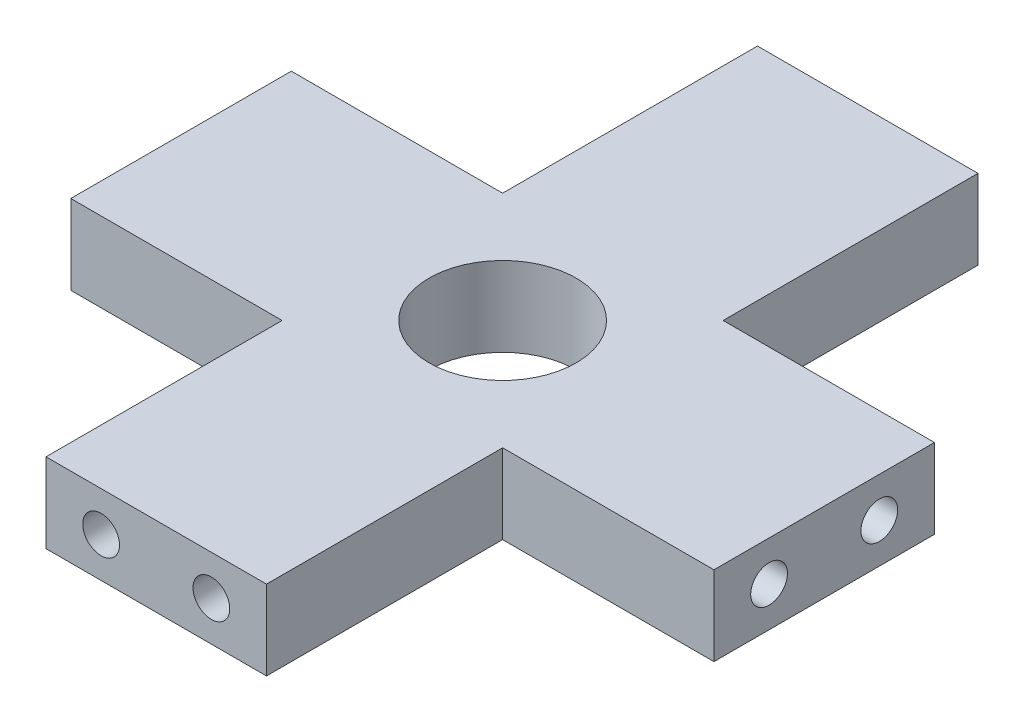
ISO-10303-21;
HEADER;
FILE_DESCRIPTION(('STEP AP214'),'2;1');
FILE_NAME('part.step','',(''),(''),'','','');
FILE_SCHEMA(('AUTOMOTIVE_DESIGN { 1 0 10303 214 1 1 1 1 }'));
ENDSEC;
DATA;
#1=APPLICATION_CONTEXT('core data for automotive mechanical design processes');
#2=APPLICATION_PROTOCOL_DEFINITION('international standard','automotive_design',2000,#1);
#3=PRODUCT_CONTEXT('',#1,'mechanical');
#4=PRODUCT('Part','Part','',(#3));
#5=PRODUCT_RELATED_PRODUCT_CATEGORY('part','',(#4));
#6=PRODUCT_DEFINITION_FORMATION('','',#4);
#7=PRODUCT_DEFINITION_CONTEXT('part definition',#1,'design');
#8=PRODUCT_DEFINITION('design','',#6,#7);
#9=PRODUCT_DEFINITION_SHAPE('','',#8);
#10=(LENGTH_UNIT() NAMED_UNIT(*) SI_UNIT(.MILLI.,.METRE.));
#11=(NAMED_UNIT(*) PLANE_ANGLE_UNIT() SI_UNIT($,.RADIAN.));
#12=(NAMED_UNIT(*) SI_UNIT($,.STERADIAN.) SOLID_ANGLE_UNIT());
#13=UNCERTAINTY_MEASURE_WITH_UNIT(LENGTH_MEASURE(1.E-05),#10,'distance_accuracy_value','');
#14=(GEOMETRIC_REPRESENTATION_CONTEXT(3) GLOBAL_UNCERTAINTY_ASSIGNED_CONTEXT((#13)) GLOBAL_UNIT_ASSIGNED_CONTEXT((#10,
#11,#12)) REPRESENTATION_CONTEXT('',''));
#15=CARTESIAN_POINT('',(0.,0.,0.));
#16=DIRECTION('',(0.,0.,1.));
#17=DIRECTION('',(1.,0.,0.));
#18=AXIS2_PLACEMENT_3D('',#15,#16,#17);
#19=CARTESIAN_POINT('',(0.,4.33,0.));
#20=DIRECTION('',(0.,-1.,0.));
#21=DIRECTION('',(0.,0.,-1.));
#22=AXIS2_PLACEMENT_3D('',#19,#20,#21);
#23=PLANE('',#22);
#24=DIRECTION('',(0.,0.,1.));
#25=VECTOR('',#24,1.);
#26=CARTESIAN_POINT('',(0.,4.33,0.));
#27=LINE('',#26,#25);
#28=CARTESIAN_POINT('',(0.,4.33,-12.85));
#29=VERTEX_POINT('',#28);
#30=CARTESIAN_POINT('',(0.,4.33,0.));
#31=VERTEX_POINT('',#30);
#32=EDGE_CURVE('E176',#29,#31,#27,.T.);
#33=ORIENTED_EDGE('',*,*,#32,.T.);
#34=DIRECTION('',(1.,0.,0.));
#35=VECTOR('',#34,1.);
#36=CARTESIAN_POINT('',(0.,4.33,0.));
#37=LINE('',#36,#35);
#38=CARTESIAN_POINT('',(12.,4.33,0.));
#39=VERTEX_POINT('',#38);
#40=EDGE_CURVE('E104',#31,#39,#37,.T.);
#41=ORIENTED_EDGE('',*,*,#40,.T.);
#42=DIRECTION('',(0.,0.,-1.));
#43=VECTOR('',#42,1.);
#44=CARTESIAN_POINT('',(12.,4.33,0.));
#45=LINE('',#44,#43);
#46=CARTESIAN_POINT('',(12.,4.33,-12.85));
#47=VERTEX_POINT('',#46);
#48=EDGE_CURVE('E203',#39,#47,#45,.T.);
#49=ORIENTED_EDGE('',*,*,#48,.T.);
#50=DIRECTION('',(1.,0.,0.));
#51=VECTOR('',#50,1.);
#52=CARTESIAN_POINT('',(12.,4.33,-12.85));
#53=LINE('',#52,#51);
#54=CARTESIAN_POINT('',(23.5,4.33,-12.85));
#55=VERTEX_POINT('',#54);
#56=EDGE_CURVE('E222',#47,#55,#53,.T.);
#57=ORIENTED_EDGE('',*,*,#56,.T.);
#58=DIRECTION('',(0.,0.,-1.));
#59=VECTOR('',#58,1.);
#60=CARTESIAN_POINT('',(23.5,4.33,-24.85));
#61=LINE('',#60,#59);
#62=CARTESIAN_POINT('',(23.5,4.33,-24.85));
#63=VERTEX_POINT('',#62);
#64=EDGE_CURVE('E219',#55,#63,#61,.T.);
#65=ORIENTED_EDGE('',*,*,#64,.T.);
#66=DIRECTION('',(-1.,0.,0.));
#67=VECTOR('',#66,1.);
#68=CARTESIAN_POINT('',(12.,4.33,-24.85));
#69=LINE('',#68,#67);
#70=CARTESIAN_POINT('',(12.,4.33,-24.85));
#71=VERTEX_POINT('',#70);
#72=EDGE_CURVE('E221',#63,#71,#69,.T.);
#73=ORIENTED_EDGE('',*,*,#72,.T.);
#74=DIRECTION('',(0.,0.,-1.));
#75=VECTOR('',#74,1.);
#76=CARTESIAN_POINT('',(12.,4.33,-24.85));
#77=LINE('',#76,#75);
#78=CARTESIAN_POINT('',(12.,4.33,-38.72));
#79=VERTEX_POINT('',#78);
#80=EDGE_CURVE('E224',#71,#79,#77,.T.);
#81=ORIENTED_EDGE('',*,*,#80,.T.);
#82=DIRECTION('',(-1.,0.,0.));
#83=VECTOR('',#82,1.);
#84=CARTESIAN_POINT('',(0.,4.33,-38.72));
#85=LINE('',#84,#83);
#86=CARTESIAN_POINT('',(0.,4.33,-38.72));
#87=VERTEX_POINT('',#86);
#88=EDGE_CURVE('E230',#79,#87,#85,.T.);
#89=ORIENTED_EDGE('',*,*,#88,.T.);
#90=DIRECTION('',(0.,0.,1.));
#91=VECTOR('',#90,1.);
#92=CARTESIAN_POINT('',(0.,4.33,-24.85));
#93=LINE('',#92,#91);
#94=CARTESIAN_POINT('',(0.,4.33,-24.85));
#95=VERTEX_POINT('',#94);
#96=EDGE_CURVE('E135',#87,#95,#93,.T.);
#97=ORIENTED_EDGE('',*,*,#96,.T.);
#98=DIRECTION('',(-1.,0.,0.));
#99=VECTOR('',#98,1.);
#100=CARTESIAN_POINT('',(-11.5,4.33,-24.85));
#101=LINE('',#100,#99);
#102=CARTESIAN_POINT('',(-11.5,4.33,-24.85));
#103=VERTEX_POINT('',#102);
#104=EDGE_CURVE('E129',#95,#103,#101,.T.);
#105=ORIENTED_EDGE('',*,*,#104,.T.);
#106=DIRECTION('',(0.,0.,1.));
#107=VECTOR('',#106,1.);
#108=CARTESIAN_POINT('',(-11.5,4.33,-24.85));
#109=LINE('',#108,#107);
#110=CARTESIAN_POINT('',(-11.5,4.33,-12.85));
#111=VERTEX_POINT('',#110);
#112=EDGE_CURVE('E133',#103,#111,#109,.T.);
#113=ORIENTED_EDGE('',*,*,#112,.T.);
#114=DIRECTION('',(1.,0.,0.));
#115=VECTOR('',#114,1.);
#116=CARTESIAN_POINT('',(-11.5,4.33,-12.85));
#117=LINE('',#116,#115);
#118=EDGE_CURVE('E49',#111,#29,#117,.T.);
#119=ORIENTED_EDGE('',*,*,#118,.T.);
#120=EDGE_LOOP('',(#33,#41,#49,#57,#65,#73,#81,#89,#97,#105,#113,#119));
#121=FACE_BOUND('',#120,.T.);
#122=CARTESIAN_POINT('',(6.,4.33,-18.85));
#123=DIRECTION('',(0.,1.,0.));
#124=DIRECTION('',(0.,0.,1.));
#125=AXIS2_PLACEMENT_3D('',#122,#123,#124);
#126=CIRCLE('',#125,4.);
#127=CARTESIAN_POINT('',(6.,4.33,-14.85));
#128=VERTEX_POINT('',#127);
#129=EDGE_CURVE('E157',#128,#128,#126,.T.);
#130=ORIENTED_EDGE('',*,*,#129,.F.);
#131=EDGE_LOOP('',(#130));
#132=FACE_BOUND('',#131,.T.);
#133=ADVANCED_FACE('F32',(#121,#132),#23,.F.);
#134=CARTESIAN_POINT('',(0.,0.,0.));
#135=DIRECTION('',(0.,-1.,0.));
#136=DIRECTION('',(0.,0.,-1.));
#137=AXIS2_PLACEMENT_3D('',#134,#135,#136);
#138=PLANE('',#137);
#139=DIRECTION('',(0.,0.,1.));
#140=VECTOR('',#139,1.);
#141=CARTESIAN_POINT('',(0.,0.,0.));
#142=LINE('',#141,#140);
#143=CARTESIAN_POINT('',(0.,0.,-12.85));
#144=VERTEX_POINT('',#143);
#145=CARTESIAN_POINT('',(0.,0.,0.));
#146=VERTEX_POINT('',#145);
#147=EDGE_CURVE('E153',#144,#146,#142,.T.);
#148=ORIENTED_EDGE('',*,*,#147,.F.);
#149=DIRECTION('',(1.,0.,0.));
#150=VECTOR('',#149,1.);
#151=CARTESIAN_POINT('',(-11.5,0.,-12.85));
#152=LINE('',#151,#150);
#153=CARTESIAN_POINT('',(-11.5,0.,-12.85));
#154=VERTEX_POINT('',#153);
#155=EDGE_CURVE('E96',#154,#144,#152,.T.);
#156=ORIENTED_EDGE('',*,*,#155,.F.);
#157=DIRECTION('',(0.,0.,1.));
#158=VECTOR('',#157,1.);
#159=CARTESIAN_POINT('',(-11.5,0.,-24.85));
#160=LINE('',#159,#158);
#161=CARTESIAN_POINT('',(-11.5,0.,-24.85));
#162=VERTEX_POINT('',#161);
#163=EDGE_CURVE('E90',#162,#154,#160,.T.);
#164=ORIENTED_EDGE('',*,*,#163,.F.);
#165=DIRECTION('',(-1.,0.,0.));
#166=VECTOR('',#165,1.);
#167=CARTESIAN_POINT('',(-11.5,0.,-24.85));
#168=LINE('',#167,#166);
#169=CARTESIAN_POINT('',(0.,0.,-24.85));
#170=VERTEX_POINT('',#169);
#171=EDGE_CURVE('E143',#170,#162,#168,.T.);
#172=ORIENTED_EDGE('',*,*,#171,.F.);
#173=DIRECTION('',(0.,0.,1.));
#174=VECTOR('',#173,1.);
#175=CARTESIAN_POINT('',(0.,0.,-24.85));
#176=LINE('',#175,#174);
#177=CARTESIAN_POINT('',(0.,0.,-38.72));
#178=VERTEX_POINT('',#177);
#179=EDGE_CURVE('E171',#178,#170,#176,.T.);
#180=ORIENTED_EDGE('',*,*,#179,.F.);
#181=DIRECTION('',(-1.,0.,0.));
#182=VECTOR('',#181,1.);
#183=CARTESIAN_POINT('',(0.,0.,-38.72));
#184=LINE('',#183,#182);
#185=CARTESIAN_POINT('',(12.,0.,-38.72));
#186=VERTEX_POINT('',#185);
#187=EDGE_CURVE('E169',#186,#178,#184,.T.);
#188=ORIENTED_EDGE('',*,*,#187,.F.);
#189=DIRECTION('',(0.,0.,-1.));
#190=VECTOR('',#189,1.);
#191=CARTESIAN_POINT('',(12.,0.,-24.85));
#192=LINE('',#191,#190);
#193=CARTESIAN_POINT('',(12.,0.,-24.85));
#194=VERTEX_POINT('',#193);
#195=EDGE_CURVE('E167',#194,#186,#192,.T.);
#196=ORIENTED_EDGE('',*,*,#195,.F.);
#197=DIRECTION('',(-1.,0.,0.));
#198=VECTOR('',#197,1.);
#199=CARTESIAN_POINT('',(12.,0.,-24.85));
#200=LINE('',#199,#198);
#201=CARTESIAN_POINT('',(23.5,0.,-24.85));
#202=VERTEX_POINT('',#201);
#203=EDGE_CURVE('E165',#202,#194,#200,.T.);
#204=ORIENTED_EDGE('',*,*,#203,.F.);
#205=DIRECTION('',(0.,0.,-1.));
#206=VECTOR('',#205,1.);
#207=CARTESIAN_POINT('',(23.5,0.,-24.85));
#208=LINE('',#207,#206);
#209=CARTESIAN_POINT('',(23.5,0.,-12.85));
#210=VERTEX_POINT('',#209);
#211=EDGE_CURVE('E163',#210,#202,#208,.T.);
#212=ORIENTED_EDGE('',*,*,#211,.F.);
#213=DIRECTION('',(1.,0.,0.));
#214=VECTOR('',#213,1.);
#215=CARTESIAN_POINT('',(12.,0.,-12.85));
#216=LINE('',#215,#214);
#217=CARTESIAN_POINT('',(12.,0.,-12.85));
#218=VERTEX_POINT('',#217);
#219=EDGE_CURVE('E161',#218,#210,#216,.T.);
#220=ORIENTED_EDGE('',*,*,#219,.F.);
#221=DIRECTION('',(0.,0.,-1.));
#222=VECTOR('',#221,1.);
#223=CARTESIAN_POINT('',(12.,0.,0.));
#224=LINE('',#223,#222);
#225=CARTESIAN_POINT('',(12.,0.,0.));
#226=VERTEX_POINT('',#225);
#227=EDGE_CURVE('E159',#226,#218,#224,.T.);
#228=ORIENTED_EDGE('',*,*,#227,.F.);
#229=DIRECTION('',(1.,0.,0.));
#230=VECTOR('',#229,1.);
#231=CARTESIAN_POINT('',(0.,0.,0.));
#232=LINE('',#231,#230);
#233=EDGE_CURVE('E156',#146,#226,#232,.T.);
#234=ORIENTED_EDGE('',*,*,#233,.F.);
#235=EDGE_LOOP('',(#148,#156,#164,#172,#180,#188,#196,#204,#212,#220,#228,#234));
#236=FACE_BOUND('',#235,.T.);
#237=CARTESIAN_POINT('',(6.,0.,-18.85));
#238=DIRECTION('',(0.,1.,0.));
#239=DIRECTION('',(0.,0.,1.));
#240=AXIS2_PLACEMENT_3D('',#237,#238,#239);
#241=CIRCLE('',#240,4.);
#242=CARTESIAN_POINT('',(6.,0.,-14.85));
#243=VERTEX_POINT('',#242);
#244=EDGE_CURVE('E370',#243,#243,#241,.T.);
#245=ORIENTED_EDGE('',*,*,#244,.T.);
#246=EDGE_LOOP('',(#245));
#247=FACE_BOUND('',#246,.T.);
#248=ADVANCED_FACE('F207',(#236,#247),#138,.T.);
#249=CARTESIAN_POINT('',(0.,4.33,0.));
#250=DIRECTION('',(1.,0.,0.));
#251=DIRECTION('',(0.,0.,-1.));
#252=AXIS2_PLACEMENT_3D('',#249,#250,#251);
#253=PLANE('',#252);
#254=ORIENTED_EDGE('',*,*,#147,.T.);
#255=DIRECTION('',(0.,-1.,0.));
#256=VECTOR('',#255,1.);
#257=CARTESIAN_POINT('',(0.,4.33,0.));
#258=LINE('',#257,#256);
#259=EDGE_CURVE('E11',#31,#146,#258,.T.);
#260=ORIENTED_EDGE('',*,*,#259,.F.);
#261=ORIENTED_EDGE('',*,*,#32,.F.);
#262=DIRECTION('',(0.,-1.,0.));
#263=VECTOR('',#262,1.);
#264=CARTESIAN_POINT('',(0.,4.33,-12.85));
#265=LINE('',#264,#263);
#266=EDGE_CURVE('E149',#29,#144,#265,.T.);
#267=ORIENTED_EDGE('',*,*,#266,.T.);
#268=EDGE_LOOP('',(#254,#260,#261,#267));
#269=FACE_BOUND('',#268,.T.);
#270=ADVANCED_FACE('F34',(#269),#253,.F.);
#271=CARTESIAN_POINT('',(0.,4.33,0.));
#272=DIRECTION('',(0.,0.,-1.));
#273=DIRECTION('',(-1.,0.,0.));
#274=AXIS2_PLACEMENT_3D('',#271,#272,#273);
#275=PLANE('',#274);
#276=CARTESIAN_POINT('',(3.,2.165,0.));
#277=DIRECTION('',(0.,0.,1.));
#278=DIRECTION('',(1.,0.,0.));
#279=AXIS2_PLACEMENT_3D('',#276,#277,#278);
#280=CIRCLE('',#279,1.);
#281=CARTESIAN_POINT('',(4.,2.165,0.));
#282=VERTEX_POINT('',#281);
#283=EDGE_CURVE('E371',#282,#282,#280,.T.);
#284=ORIENTED_EDGE('',*,*,#283,.F.);
#285=EDGE_LOOP('',(#284));
#286=FACE_BOUND('',#285,.T.);
#287=CARTESIAN_POINT('',(9.,2.165,0.));
#288=DIRECTION('',(0.,0.,1.));
#289=DIRECTION('',(1.,0.,0.));
#290=AXIS2_PLACEMENT_3D('',#287,#288,#289);
#291=CIRCLE('',#290,1.);
#292=CARTESIAN_POINT('',(10.,2.165,0.));
#293=VERTEX_POINT('',#292);
#294=EDGE_CURVE('E358',#293,#293,#291,.T.);
#295=ORIENTED_EDGE('',*,*,#294,.F.);
#296=EDGE_LOOP('',(#295));
#297=FACE_BOUND('',#296,.T.);
#298=ORIENTED_EDGE('',*,*,#233,.T.);
#299=DIRECTION('',(0.,-1.,0.));
#300=VECTOR('',#299,1.);
#301=CARTESIAN_POINT('',(12.,4.33,0.));
#302=LINE('',#301,#300);
#303=EDGE_CURVE('E41',#39,#226,#302,.T.);
#304=ORIENTED_EDGE('',*,*,#303,.F.);
#305=ORIENTED_EDGE('',*,*,#40,.F.);
#306=ORIENTED_EDGE('',*,*,#259,.T.);
#307=EDGE_LOOP('',(#298,#304,#305,#306));
#308=FACE_BOUND('',#307,.T.);
#309=ADVANCED_FACE('F390',(#286,#297,#308),#275,.F.);
#310=CARTESIAN_POINT('',(12.,4.33,0.));
#311=DIRECTION('',(-1.,0.,0.));
#312=DIRECTION('',(0.,0.,1.));
#313=AXIS2_PLACEMENT_3D('',#310,#311,#312);
#314=PLANE('',#313);
#315=ORIENTED_EDGE('',*,*,#227,.T.);
#316=DIRECTION('',(0.,-1.,0.));
#317=VECTOR('',#316,1.);
#318=CARTESIAN_POINT('',(12.,4.33,-12.85));
#319=LINE('',#318,#317);
#320=EDGE_CURVE('E195',#47,#218,#319,.T.);
#321=ORIENTED_EDGE('',*,*,#320,.F.);
#322=ORIENTED_EDGE('',*,*,#48,.F.);
#323=ORIENTED_EDGE('',*,*,#303,.T.);
#324=EDGE_LOOP('',(#315,#321,#322,#323));
#325=FACE_BOUND('',#324,.T.);
#326=ADVANCED_FACE('F201',(#325),#314,.F.);
#327=CARTESIAN_POINT('',(12.,4.33,-12.85));
#328=DIRECTION('',(0.,0.,-1.));
#329=DIRECTION('',(-1.,0.,0.));
#330=AXIS2_PLACEMENT_3D('',#327,#328,#329);
#331=PLANE('',#330);
#332=ORIENTED_EDGE('',*,*,#219,.T.);
#333=DIRECTION('',(0.,-1.,0.));
#334=VECTOR('',#333,1.);
#335=CARTESIAN_POINT('',(23.5,4.33,-12.85));
#336=LINE('',#335,#334);
#337=EDGE_CURVE('E192',#55,#210,#336,.T.);
#338=ORIENTED_EDGE('',*,*,#337,.F.);
#339=ORIENTED_EDGE('',*,*,#56,.F.);
#340=ORIENTED_EDGE('',*,*,#320,.T.);
#341=EDGE_LOOP('',(#332,#338,#339,#340));
#342=FACE_BOUND('',#341,.T.);
#343=ADVANCED_FACE('F213',(#342),#331,.F.);
#344=CARTESIAN_POINT('',(23.5,4.33,-24.85));
#345=DIRECTION('',(-1.,0.,0.));
#346=DIRECTION('',(0.,0.,1.));
#347=AXIS2_PLACEMENT_3D('',#344,#345,#346);
#348=PLANE('',#347);
#349=CARTESIAN_POINT('',(23.5,2.165,-15.85));
#350=DIRECTION('',(1.,0.,0.));
#351=DIRECTION('',(0.,0.,-1.));
#352=AXIS2_PLACEMENT_3D('',#349,#350,#351);
#353=CIRCLE('',#352,1.);
#354=CARTESIAN_POINT('',(23.5,2.165,-16.85));
#355=VERTEX_POINT('',#354);
#356=EDGE_CURVE('E332',#355,#355,#353,.T.);
#357=ORIENTED_EDGE('',*,*,#356,.F.);
#358=EDGE_LOOP('',(#357));
#359=FACE_BOUND('',#358,.T.);
#360=CARTESIAN_POINT('',(23.5,2.165,-21.85));
#361=DIRECTION('',(1.,0.,0.));
#362=DIRECTION('',(0.,0.,-1.));
#363=AXIS2_PLACEMENT_3D('',#360,#361,#362);
#364=CIRCLE('',#363,1.);
#365=CARTESIAN_POINT('',(23.5,2.165,-22.85));
#366=VERTEX_POINT('',#365);
#367=EDGE_CURVE('E343',#366,#366,#364,.T.);
#368=ORIENTED_EDGE('',*,*,#367,.F.);
#369=EDGE_LOOP('',(#368));
#370=FACE_BOUND('',#369,.T.);
#371=ORIENTED_EDGE('',*,*,#211,.T.);
#372=DIRECTION('',(0.,-1.,0.));
#373=VECTOR('',#372,1.);
#374=CARTESIAN_POINT('',(23.5,4.33,-24.85));
#375=LINE('',#374,#373);
#376=EDGE_CURVE('E189',#63,#202,#375,.T.);
#377=ORIENTED_EDGE('',*,*,#376,.F.);
#378=ORIENTED_EDGE('',*,*,#64,.F.);
#379=ORIENTED_EDGE('',*,*,#337,.T.);
#380=EDGE_LOOP('',(#371,#377,#378,#379));
#381=FACE_BOUND('',#380,.T.);
#382=ADVANCED_FACE('F217',(#359,#370,#381),#348,.F.);
#383=CARTESIAN_POINT('',(12.,4.33,-24.85));
#384=DIRECTION('',(0.,0.,1.));
#385=DIRECTION('',(1.,0.,0.));
#386=AXIS2_PLACEMENT_3D('',#383,#384,#385);
#387=PLANE('',#386);
#388=ORIENTED_EDGE('',*,*,#203,.T.);
#389=DIRECTION('',(0.,-1.,0.));
#390=VECTOR('',#389,1.);
#391=CARTESIAN_POINT('',(12.,4.33,-24.85));
#392=LINE('',#391,#390);
#393=EDGE_CURVE('E186',#71,#194,#392,.T.);
#394=ORIENTED_EDGE('',*,*,#393,.F.);
#395=ORIENTED_EDGE('',*,*,#72,.F.);
#396=ORIENTED_EDGE('',*,*,#376,.T.);
#397=EDGE_LOOP('',(#388,#394,#395,#396));
#398=FACE_BOUND('',#397,.T.);
#399=ADVANCED_FACE('F404',(#398),#387,.F.);
#400=CARTESIAN_POINT('',(12.,4.33,-24.85));
#401=DIRECTION('',(-1.,0.,0.));
#402=DIRECTION('',(0.,0.,1.));
#403=AXIS2_PLACEMENT_3D('',#400,#401,#402);
#404=PLANE('',#403);
#405=ORIENTED_EDGE('',*,*,#195,.T.);
#406=DIRECTION('',(0.,-1.,0.));
#407=VECTOR('',#406,1.);
#408=CARTESIAN_POINT('',(12.,4.33,-38.72));
#409=LINE('',#408,#407);
#410=EDGE_CURVE('E183',#79,#186,#409,.T.);
#411=ORIENTED_EDGE('',*,*,#410,.F.);
#412=ORIENTED_EDGE('',*,*,#80,.F.);
#413=ORIENTED_EDGE('',*,*,#393,.T.);
#414=EDGE_LOOP('',(#405,#411,#412,#413));
#415=FACE_BOUND('',#414,.T.);
#416=ADVANCED_FACE('F408',(#415),#404,.F.);
#417=CARTESIAN_POINT('',(0.,4.33,-38.72));
#418=DIRECTION('',(0.,0.,1.));
#419=DIRECTION('',(1.,0.,0.));
#420=AXIS2_PLACEMENT_3D('',#417,#418,#419);
#421=PLANE('',#420);
#422=CARTESIAN_POINT('',(9.,2.165,-38.72));
#423=DIRECTION('',(0.,0.,-1.));
#424=DIRECTION('',(-1.,0.,0.));
#425=AXIS2_PLACEMENT_3D('',#422,#423,#424);
#426=CIRCLE('',#425,1.);
#427=CARTESIAN_POINT('',(8.,2.165,-38.72));
#428=VERTEX_POINT('',#427);
#429=EDGE_CURVE('E350',#428,#428,#426,.T.);
#430=ORIENTED_EDGE('',*,*,#429,.F.);
#431=EDGE_LOOP('',(#430));
#432=FACE_BOUND('',#431,.T.);
#433=CARTESIAN_POINT('',(3.,2.165,-38.72));
#434=DIRECTION('',(0.,0.,-1.));
#435=DIRECTION('',(-1.,0.,0.));
#436=AXIS2_PLACEMENT_3D('',#433,#434,#435);
#437=CIRCLE('',#436,1.);
#438=CARTESIAN_POINT('',(2.,2.165,-38.72));
#439=VERTEX_POINT('',#438);
#440=EDGE_CURVE('E331',#439,#439,#437,.T.);
#441=ORIENTED_EDGE('',*,*,#440,.F.);
#442=EDGE_LOOP('',(#441));
#443=FACE_BOUND('',#442,.T.);
#444=ORIENTED_EDGE('',*,*,#187,.T.);
#445=DIRECTION('',(0.,-1.,0.));
#446=VECTOR('',#445,1.);
#447=CARTESIAN_POINT('',(0.,4.33,-38.72));
#448=LINE('',#447,#446);
#449=EDGE_CURVE('E180',#87,#178,#448,.T.);
#450=ORIENTED_EDGE('',*,*,#449,.F.);
#451=ORIENTED_EDGE('',*,*,#88,.F.);
#452=ORIENTED_EDGE('',*,*,#410,.T.);
#453=EDGE_LOOP('',(#444,#450,#451,#452));
#454=FACE_BOUND('',#453,.T.);
#455=ADVANCED_FACE('F236',(#432,#443,#454),#421,.F.);
#456=CARTESIAN_POINT('',(0.,4.33,-24.85));
#457=DIRECTION('',(1.,0.,0.));
#458=DIRECTION('',(0.,0.,-1.));
#459=AXIS2_PLACEMENT_3D('',#456,#457,#458);
#460=PLANE('',#459);
#461=ORIENTED_EDGE('',*,*,#179,.T.);
#462=DIRECTION('',(0.,-1.,0.));
#463=VECTOR('',#462,1.);
#464=CARTESIAN_POINT('',(0.,4.33,-24.85));
#465=LINE('',#464,#463);
#466=EDGE_CURVE('E144',#95,#170,#465,.T.);
#467=ORIENTED_EDGE('',*,*,#466,.F.);
#468=ORIENTED_EDGE('',*,*,#96,.F.);
#469=ORIENTED_EDGE('',*,*,#449,.T.);
#470=EDGE_LOOP('',(#461,#467,#468,#469));
#471=FACE_BOUND('',#470,.T.);
#472=ADVANCED_FACE('F240',(#471),#460,.F.);
#473=CARTESIAN_POINT('',(-11.5,4.33,-24.85));
#474=DIRECTION('',(0.,0.,1.));
#475=DIRECTION('',(1.,0.,0.));
#476=AXIS2_PLACEMENT_3D('',#473,#474,#475);
#477=PLANE('',#476);
#478=ORIENTED_EDGE('',*,*,#171,.T.);
#479=DIRECTION('',(0.,-1.,0.));
#480=VECTOR('',#479,1.);
#481=CARTESIAN_POINT('',(-11.5,4.33,-24.85));
#482=LINE('',#481,#480);
#483=EDGE_CURVE('E140',#103,#162,#482,.T.);
#484=ORIENTED_EDGE('',*,*,#483,.F.);
#485=ORIENTED_EDGE('',*,*,#104,.F.);
#486=ORIENTED_EDGE('',*,*,#466,.T.);
#487=EDGE_LOOP('',(#478,#484,#485,#486));
#488=FACE_BOUND('',#487,.T.);
#489=ADVANCED_FACE('F141',(#488),#477,.F.);
#490=CARTESIAN_POINT('',(-11.5,4.33,-24.85));
#491=DIRECTION('',(1.,0.,0.));
#492=DIRECTION('',(0.,0.,-1.));
#493=AXIS2_PLACEMENT_3D('',#490,#491,#492);
#494=PLANE('',#493);
#495=CARTESIAN_POINT('',(-11.5,2.165,-21.85));
#496=DIRECTION('',(-1.,0.,0.));
#497=DIRECTION('',(0.,0.,1.));
#498=AXIS2_PLACEMENT_3D('',#495,#496,#497);
#499=CIRCLE('',#498,1.);
#500=CARTESIAN_POINT('',(-11.5,2.165,-20.85));
#501=VERTEX_POINT('',#500);
#502=EDGE_CURVE('E359',#501,#501,#499,.T.);
#503=ORIENTED_EDGE('',*,*,#502,.F.);
#504=EDGE_LOOP('',(#503));
#505=FACE_BOUND('',#504,.T.);
#506=CARTESIAN_POINT('',(-11.5,2.165,-15.85));
#507=DIRECTION('',(-1.,0.,0.));
#508=DIRECTION('',(0.,0.,1.));
#509=AXIS2_PLACEMENT_3D('',#506,#507,#508);
#510=CIRCLE('',#509,1.);
#511=CARTESIAN_POINT('',(-11.5,2.165,-14.85));
#512=VERTEX_POINT('',#511);
#513=EDGE_CURVE('E349',#512,#512,#510,.T.);
#514=ORIENTED_EDGE('',*,*,#513,.F.);
#515=EDGE_LOOP('',(#514));
#516=FACE_BOUND('',#515,.T.);
#517=ORIENTED_EDGE('',*,*,#163,.T.);
#518=DIRECTION('',(0.,-1.,0.));
#519=VECTOR('',#518,1.);
#520=CARTESIAN_POINT('',(-11.5,4.33,-12.85));
#521=LINE('',#520,#519);
#522=EDGE_CURVE('E145',#111,#154,#521,.T.);
#523=ORIENTED_EDGE('',*,*,#522,.F.);
#524=ORIENTED_EDGE('',*,*,#112,.F.);
#525=ORIENTED_EDGE('',*,*,#483,.T.);
#526=EDGE_LOOP('',(#517,#523,#524,#525));
#527=FACE_BOUND('',#526,.T.);
#528=ADVANCED_FACE('F147',(#505,#516,#527),#494,.F.);
#529=CARTESIAN_POINT('',(-11.5,4.33,-12.85));
#530=DIRECTION('',(0.,0.,-1.));
#531=DIRECTION('',(-1.,0.,0.));
#532=AXIS2_PLACEMENT_3D('',#529,#530,#531);
#533=PLANE('',#532);
#534=ORIENTED_EDGE('',*,*,#155,.T.);
#535=ORIENTED_EDGE('',*,*,#266,.F.);
#536=ORIENTED_EDGE('',*,*,#118,.F.);
#537=ORIENTED_EDGE('',*,*,#522,.T.);
#538=EDGE_LOOP('',(#534,#535,#536,#537));
#539=FACE_BOUND('',#538,.T.);
#540=ADVANCED_FACE('F244',(#539),#533,.F.);
#541=CARTESIAN_POINT('',(6.,4.33,-18.85));
#542=DIRECTION('',(0.,-1.,0.));
#543=DIRECTION('',(0.,0.,-1.));
#544=AXIS2_PLACEMENT_3D('',#541,#542,#543);
#545=CYLINDRICAL_SURFACE('',#544,4.);
#546=ORIENTED_EDGE('',*,*,#129,.T.);
#547=EDGE_LOOP('',(#546));
#548=FACE_BOUND('',#547,.T.);
#549=ORIENTED_EDGE('',*,*,#244,.F.);
#550=EDGE_LOOP('',(#549));
#551=FACE_BOUND('',#550,.T.);
#552=ADVANCED_FACE('F246',(#548,#551),#545,.F.);
#553=CARTESIAN_POINT('',(9.,2.165,-5.));
#554=DIRECTION('',(0.,0.,1.));
#555=DIRECTION('',(1.,0.,0.));
#556=AXIS2_PLACEMENT_3D('',#553,#554,#555);
#557=CYLINDRICAL_SURFACE('',#556,1.);
#558=CARTESIAN_POINT('',(9.,2.165,-5.));
#559=DIRECTION('',(0.,0.,1.));
#560=DIRECTION('',(1.,0.,0.));
#561=AXIS2_PLACEMENT_3D('',#558,#559,#560);
#562=CIRCLE('',#561,1.);
#563=CARTESIAN_POINT('',(10.,2.165,-5.));
#564=VERTEX_POINT('',#563);
#565=EDGE_CURVE('E374',#564,#564,#562,.T.);
#566=ORIENTED_EDGE('',*,*,#565,.F.);
#567=EDGE_LOOP('',(#566));
#568=FACE_BOUND('',#567,.T.);
#569=ORIENTED_EDGE('',*,*,#294,.T.);
#570=EDGE_LOOP('',(#569));
#571=FACE_BOUND('',#570,.T.);
#572=ADVANCED_FACE('F252',(#568,#571),#557,.F.);
#573=CARTESIAN_POINT('',(9.,2.165,-5.));
#574=DIRECTION('',(0.,0.,1.));
#575=DIRECTION('',(1.,0.,0.));
#576=AXIS2_PLACEMENT_3D('',#573,#574,#575);
#577=PLANE('',#576);
#578=ORIENTED_EDGE('',*,*,#565,.T.);
#579=EDGE_LOOP('',(#578));
#580=FACE_BOUND('',#579,.T.);
#581=ADVANCED_FACE('F266',(#580),#577,.T.);
#582=CARTESIAN_POINT('',(3.,2.165,-5.));
#583=DIRECTION('',(0.,0.,1.));
#584=DIRECTION('',(1.,0.,0.));
#585=AXIS2_PLACEMENT_3D('',#582,#583,#584);
#586=CYLINDRICAL_SURFACE('',#585,1.);
#587=CARTESIAN_POINT('',(3.,2.165,-5.));
#588=DIRECTION('',(0.,0.,1.));
#589=DIRECTION('',(1.,0.,0.));
#590=AXIS2_PLACEMENT_3D('',#587,#588,#589);
#591=CIRCLE('',#590,1.);
#592=CARTESIAN_POINT('',(4.,2.165,-5.));
#593=VERTEX_POINT('',#592);
#594=EDGE_CURVE('E367',#593,#593,#591,.T.);
#595=ORIENTED_EDGE('',*,*,#594,.F.);
#596=EDGE_LOOP('',(#595));
#597=FACE_BOUND('',#596,.T.);
#598=ORIENTED_EDGE('',*,*,#283,.T.);
#599=EDGE_LOOP('',(#598));
#600=FACE_BOUND('',#599,.T.);
#601=ADVANCED_FACE('F270',(#597,#600),#586,.F.);
#602=CARTESIAN_POINT('',(3.,2.165,-5.));
#603=DIRECTION('',(0.,0.,1.));
#604=DIRECTION('',(1.,0.,0.));
#605=AXIS2_PLACEMENT_3D('',#602,#603,#604);
#606=PLANE('',#605);
#607=ORIENTED_EDGE('',*,*,#594,.T.);
#608=EDGE_LOOP('',(#607));
#609=FACE_BOUND('',#608,.T.);
#610=ADVANCED_FACE('F274',(#609),#606,.T.);
#611=CARTESIAN_POINT('',(-6.5,2.165,-15.85));
#612=DIRECTION('',(-1.,0.,0.));
#613=DIRECTION('',(0.,0.,1.));
#614=AXIS2_PLACEMENT_3D('',#611,#612,#613);
#615=CYLINDRICAL_SURFACE('',#614,1.);
#616=CARTESIAN_POINT('',(-6.5,2.165,-15.85));
#617=DIRECTION('',(-1.,0.,0.));
#618=DIRECTION('',(0.,0.,1.));
#619=AXIS2_PLACEMENT_3D('',#616,#617,#618);
#620=CIRCLE('',#619,1.);
#621=CARTESIAN_POINT('',(-6.5,2.165,-14.85));
#622=VERTEX_POINT('',#621);
#623=EDGE_CURVE('E362',#622,#622,#620,.T.);
#624=ORIENTED_EDGE('',*,*,#623,.F.);
#625=EDGE_LOOP('',(#624));
#626=FACE_BOUND('',#625,.T.);
#627=ORIENTED_EDGE('',*,*,#513,.T.);
#628=EDGE_LOOP('',(#627));
#629=FACE_BOUND('',#628,.T.);
#630=ADVANCED_FACE('F278',(#626,#629),#615,.F.);
#631=CARTESIAN_POINT('',(-6.5,2.165,-15.85));
#632=DIRECTION('',(-1.,0.,0.));
#633=DIRECTION('',(0.,0.,1.));
#634=AXIS2_PLACEMENT_3D('',#631,#632,#633);
#635=PLANE('',#634);
#636=ORIENTED_EDGE('',*,*,#623,.T.);
#637=EDGE_LOOP('',(#636));
#638=FACE_BOUND('',#637,.T.);
#639=ADVANCED_FACE('F282',(#638),#635,.T.);
#640=CARTESIAN_POINT('',(-6.5,2.165,-21.85));
#641=DIRECTION('',(-1.,0.,0.));
#642=DIRECTION('',(0.,0.,1.));
#643=AXIS2_PLACEMENT_3D('',#640,#641,#642);
#644=CYLINDRICAL_SURFACE('',#643,1.);
#645=CARTESIAN_POINT('',(-6.5,2.165,-21.85));
#646=DIRECTION('',(-1.,0.,0.));
#647=DIRECTION('',(0.,0.,1.));
#648=AXIS2_PLACEMENT_3D('',#645,#646,#647);
#649=CIRCLE('',#648,1.);
#650=CARTESIAN_POINT('',(-6.5,2.165,-20.85));
#651=VERTEX_POINT('',#650);
#652=EDGE_CURVE('E355',#651,#651,#649,.T.);
#653=ORIENTED_EDGE('',*,*,#652,.F.);
#654=EDGE_LOOP('',(#653));
#655=FACE_BOUND('',#654,.T.);
#656=ORIENTED_EDGE('',*,*,#502,.T.);
#657=EDGE_LOOP('',(#656));
#658=FACE_BOUND('',#657,.T.);
#659=ADVANCED_FACE('F286',(#655,#658),#644,.F.);
#660=CARTESIAN_POINT('',(-6.5,2.165,-21.85));
#661=DIRECTION('',(-1.,0.,0.));
#662=DIRECTION('',(0.,0.,1.));
#663=AXIS2_PLACEMENT_3D('',#660,#661,#662);
#664=PLANE('',#663);
#665=ORIENTED_EDGE('',*,*,#652,.T.);
#666=EDGE_LOOP('',(#665));
#667=FACE_BOUND('',#666,.T.);
#668=ADVANCED_FACE('F290',(#667),#664,.T.);
#669=CARTESIAN_POINT('',(3.,2.165,-33.72));
#670=DIRECTION('',(0.,0.,-1.));
#671=DIRECTION('',(-1.,0.,0.));
#672=AXIS2_PLACEMENT_3D('',#669,#670,#671);
#673=CYLINDRICAL_SURFACE('',#672,1.);
#674=CARTESIAN_POINT('',(3.,2.165,-33.72));
#675=DIRECTION('',(0.,0.,-1.));
#676=DIRECTION('',(-1.,0.,0.));
#677=AXIS2_PLACEMENT_3D('',#674,#675,#676);
#678=CIRCLE('',#677,1.);
#679=CARTESIAN_POINT('',(2.,2.165,-33.72));
#680=VERTEX_POINT('',#679);
#681=EDGE_CURVE('E335',#680,#680,#678,.T.);
#682=ORIENTED_EDGE('',*,*,#681,.F.);
#683=EDGE_LOOP('',(#682));
#684=FACE_BOUND('',#683,.T.);
#685=ORIENTED_EDGE('',*,*,#440,.T.);
#686=EDGE_LOOP('',(#685));
#687=FACE_BOUND('',#686,.T.);
#688=ADVANCED_FACE('F294',(#684,#687),#673,.F.);
#689=CARTESIAN_POINT('',(3.,2.165,-33.72));
#690=DIRECTION('',(0.,0.,-1.));
#691=DIRECTION('',(-1.,0.,0.));
#692=AXIS2_PLACEMENT_3D('',#689,#690,#691);
#693=PLANE('',#692);
#694=ORIENTED_EDGE('',*,*,#681,.T.);
#695=EDGE_LOOP('',(#694));
#696=FACE_BOUND('',#695,.T.);
#697=ADVANCED_FACE('F298',(#696),#693,.T.);
#698=CARTESIAN_POINT('',(9.,2.165,-33.72));
#699=DIRECTION('',(0.,0.,-1.));
#700=DIRECTION('',(-1.,0.,0.));
#701=AXIS2_PLACEMENT_3D('',#698,#699,#700);
#702=CYLINDRICAL_SURFACE('',#701,1.);
#703=CARTESIAN_POINT('',(9.,2.165,-33.72));
#704=DIRECTION('',(0.,0.,-1.));
#705=DIRECTION('',(-1.,0.,0.));
#706=AXIS2_PLACEMENT_3D('',#703,#704,#705);
#707=CIRCLE('',#706,1.);
#708=CARTESIAN_POINT('',(8.,2.165,-33.72));
#709=VERTEX_POINT('',#708);
#710=EDGE_CURVE('E346',#709,#709,#707,.T.);
#711=ORIENTED_EDGE('',*,*,#710,.F.);
#712=EDGE_LOOP('',(#711));
#713=FACE_BOUND('',#712,.T.);
#714=ORIENTED_EDGE('',*,*,#429,.T.);
#715=EDGE_LOOP('',(#714));
#716=FACE_BOUND('',#715,.T.);
#717=ADVANCED_FACE('F302',(#713,#716),#702,.F.);
#718=CARTESIAN_POINT('',(9.,2.165,-33.72));
#719=DIRECTION('',(0.,0.,-1.));
#720=DIRECTION('',(-1.,0.,0.));
#721=AXIS2_PLACEMENT_3D('',#718,#719,#720);
#722=PLANE('',#721);
#723=ORIENTED_EDGE('',*,*,#710,.T.);
#724=EDGE_LOOP('',(#723));
#725=FACE_BOUND('',#724,.T.);
#726=ADVANCED_FACE('F306',(#725),#722,.T.);
#727=CARTESIAN_POINT('',(18.5,2.165,-21.85));
#728=DIRECTION('',(1.,0.,0.));
#729=DIRECTION('',(0.,0.,-1.));
#730=AXIS2_PLACEMENT_3D('',#727,#728,#729);
#731=CYLINDRICAL_SURFACE('',#730,1.);
#732=CARTESIAN_POINT('',(18.5,2.165,-21.85));
#733=DIRECTION('',(1.,0.,0.));
#734=DIRECTION('',(0.,0.,-1.));
#735=AXIS2_PLACEMENT_3D('',#732,#733,#734);
#736=CIRCLE('',#735,1.);
#737=CARTESIAN_POINT('',(18.5,2.165,-22.85));
#738=VERTEX_POINT('',#737);
#739=EDGE_CURVE('E338',#738,#738,#736,.T.);
#740=ORIENTED_EDGE('',*,*,#739,.F.);
#741=EDGE_LOOP('',(#740));
#742=FACE_BOUND('',#741,.T.);
#743=ORIENTED_EDGE('',*,*,#367,.T.);
#744=EDGE_LOOP('',(#743));
#745=FACE_BOUND('',#744,.T.);
#746=ADVANCED_FACE('F310',(#742,#745),#731,.F.);
#747=CARTESIAN_POINT('',(18.5,2.165,-21.85));
#748=DIRECTION('',(1.,0.,0.));
#749=DIRECTION('',(0.,0.,-1.));
#750=AXIS2_PLACEMENT_3D('',#747,#748,#749);
#751=PLANE('',#750);
#752=ORIENTED_EDGE('',*,*,#739,.T.);
#753=EDGE_LOOP('',(#752));
#754=FACE_BOUND('',#753,.T.);
#755=ADVANCED_FACE('F314',(#754),#751,.T.);
#756=CARTESIAN_POINT('',(18.5,2.165,-15.85));
#757=DIRECTION('',(1.,0.,0.));
#758=DIRECTION('',(0.,0.,-1.));
#759=AXIS2_PLACEMENT_3D('',#756,#757,#758);
#760=CYLINDRICAL_SURFACE('',#759,1.);
#761=CARTESIAN_POINT('',(18.5,2.165,-15.85));
#762=DIRECTION('',(1.,0.,0.));
#763=DIRECTION('',(0.,0.,-1.));
#764=AXIS2_PLACEMENT_3D('',#761,#762,#763);
#765=CIRCLE('',#764,1.);
#766=CARTESIAN_POINT('',(18.5,2.165,-16.85));
#767=VERTEX_POINT('',#766);
#768=EDGE_CURVE('E330',#767,#767,#765,.T.);
#769=ORIENTED_EDGE('',*,*,#768,.F.);
#770=EDGE_LOOP('',(#769));
#771=FACE_BOUND('',#770,.T.);
#772=ORIENTED_EDGE('',*,*,#356,.T.);
#773=EDGE_LOOP('',(#772));
#774=FACE_BOUND('',#773,.T.);
#775=ADVANCED_FACE('F318',(#771,#774),#760,.F.);
#776=CARTESIAN_POINT('',(18.5,2.165,-15.85));
#777=DIRECTION('',(1.,0.,0.));
#778=DIRECTION('',(0.,0.,-1.));
#779=AXIS2_PLACEMENT_3D('',#776,#777,#778);
#780=PLANE('',#779);
#781=ORIENTED_EDGE('',*,*,#768,.T.);
#782=EDGE_LOOP('',(#781));
#783=FACE_BOUND('',#782,.T.);
#784=ADVANCED_FACE('F322',(#783),#780,.T.);
#785=CLOSED_SHELL('',(#133,#248,#270,#309,#326,#343,#382,#399,#416,#455,#472,#489,#528,#540,
#552,#572,#581,#601,#610,#630,#639,#659,#668,#688,#697,#717,#726,#746,#755,#775,#784));
#786=MANIFOLD_SOLID_BREP('B2',#785);
#787=ADVANCED_BREP_SHAPE_REPRESENTATION('',(#18,#786),#14);
#788=SHAPE_DEFINITION_REPRESENTATION(#9,#787);
ENDSEC;
END-ISO-10303-21;
